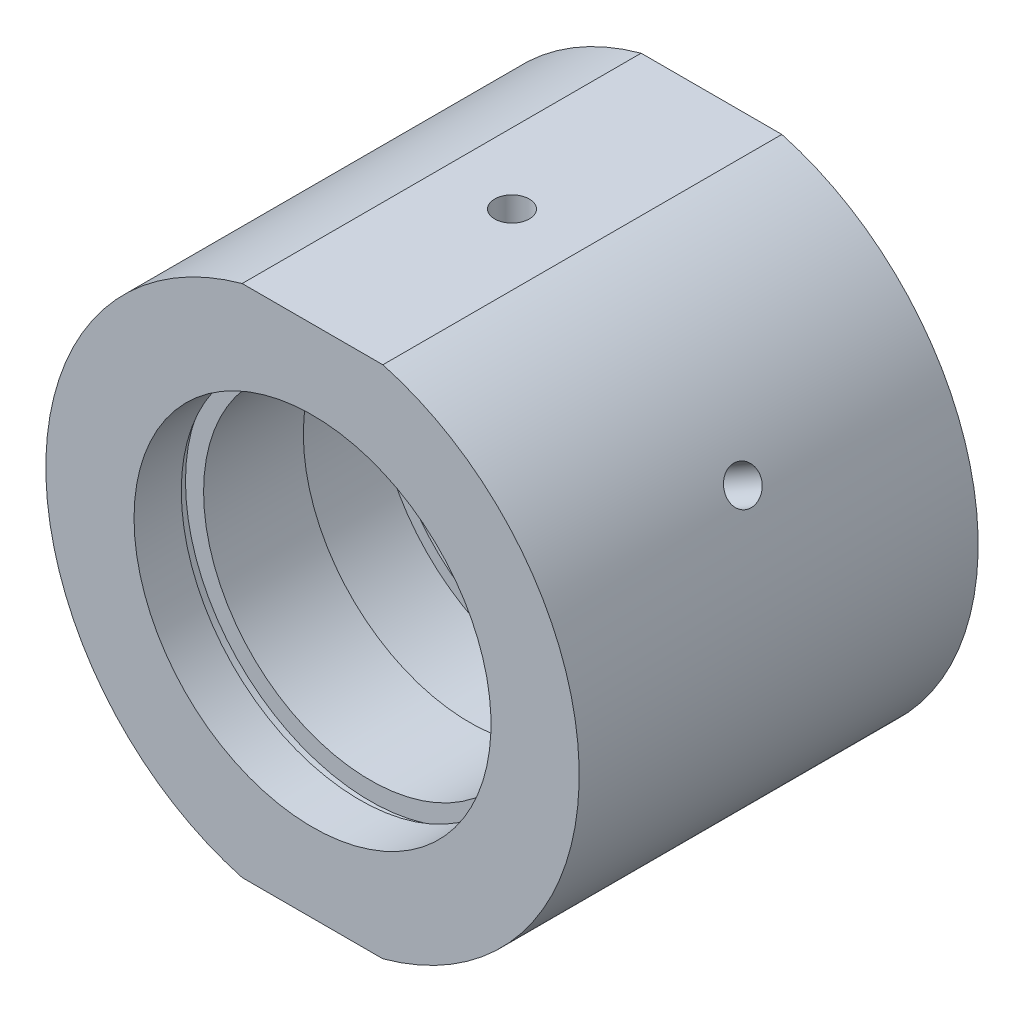
ISO-10303-21;
HEADER;
FILE_DESCRIPTION(('STEP AP214'),'2;1');
FILE_NAME('part.step','',(''),(''),'','','');
FILE_SCHEMA(('AUTOMOTIVE_DESIGN { 1 0 10303 214 1 1 1 1 }'));
ENDSEC;
DATA;
#1=APPLICATION_CONTEXT('core data for automotive mechanical design processes');
#2=APPLICATION_PROTOCOL_DEFINITION('international standard','automotive_design',2000,#1);
#3=PRODUCT_CONTEXT('',#1,'mechanical');
#4=PRODUCT('Part','Part','',(#3));
#5=PRODUCT_RELATED_PRODUCT_CATEGORY('part','',(#4));
#6=PRODUCT_DEFINITION_FORMATION('','',#4);
#7=PRODUCT_DEFINITION_CONTEXT('part definition',#1,'design');
#8=PRODUCT_DEFINITION('design','',#6,#7);
#9=PRODUCT_DEFINITION_SHAPE('','',#8);
#10=(LENGTH_UNIT() NAMED_UNIT(*) SI_UNIT(.MILLI.,.METRE.));
#11=(NAMED_UNIT(*) PLANE_ANGLE_UNIT() SI_UNIT($,.RADIAN.));
#12=(NAMED_UNIT(*) SI_UNIT($,.STERADIAN.) SOLID_ANGLE_UNIT());
#13=UNCERTAINTY_MEASURE_WITH_UNIT(LENGTH_MEASURE(1.E-05),#10,'distance_accuracy_value','');
#14=(GEOMETRIC_REPRESENTATION_CONTEXT(3) GLOBAL_UNCERTAINTY_ASSIGNED_CONTEXT((#13)) GLOBAL_UNIT_ASSIGNED_CONTEXT((#10,
#11,#12)) REPRESENTATION_CONTEXT('',''));
#15=CARTESIAN_POINT('',(0.,0.,0.));
#16=DIRECTION('',(0.,0.,1.));
#17=DIRECTION('',(1.,0.,0.));
#18=AXIS2_PLACEMENT_3D('',#15,#16,#17);
#19=CARTESIAN_POINT('',(0.,0.,-31.9390681003584));
#20=DIRECTION('',(0.,0.,-1.));
#21=DIRECTION('',(-1.,0.,0.));
#22=AXIS2_PLACEMENT_3D('',#19,#20,#21);
#23=CYLINDRICAL_SURFACE('',#22,25.4);
#24=CARTESIAN_POINT('',(21.1255837052229,14.1021173273243,0.));
#25=CARTESIAN_POINT('',(21.1255863615312,14.1021141605083,-0.0925762563152313));
#26=CARTESIAN_POINT('',(21.1299363854258,14.0956035641206,-0.18521714935843));
#27=CARTESIAN_POINT('',(21.1471903326474,14.0697041126058,-0.367940352830906));
#28=CARTESIAN_POINT('',(21.1601041850746,14.0503003087446,-0.458019566611406));
#29=CARTESIAN_POINT('',(21.1940041030208,13.9991116481198,-0.632946226853726));
#30=CARTESIAN_POINT('',(21.2149858749936,13.9673333766262,-0.717796428246381));
#31=CARTESIAN_POINT('',(21.2642526004663,13.8922125376661,-0.879890058522678));
#32=CARTESIAN_POINT('',(21.292535893129,13.8488725999941,-0.957135211772868));
#33=CARTESIAN_POINT('',(21.3554466990147,13.7516632788366,-1.1019726091419));
#34=CARTESIAN_POINT('',(21.3900831871358,13.6977789924932,-1.1695509539082));
#35=CARTESIAN_POINT('',(21.4644736584157,13.5809115475335,-1.29301742319575));
#36=CARTESIAN_POINT('',(21.5042278559428,13.5179280077581,-1.34890505776411));
#37=CARTESIAN_POINT('',(21.5875527489257,13.3844593266428,-1.44744666643091));
#38=CARTESIAN_POINT('',(21.631126729652,13.3139677164302,-1.49008910270414));
#39=CARTESIAN_POINT('',(21.7206441675858,13.1674212213743,-1.5608559839938));
#40=CARTESIAN_POINT('',(21.7665875977651,13.0913663999864,-1.58898059457471));
#41=CARTESIAN_POINT('',(21.8593422054505,12.9358933258085,-1.62987480068592));
#42=CARTESIAN_POINT('',(21.906152053296,12.8564800197265,-1.64266621735386));
#43=CARTESIAN_POINT('',(21.9993099582266,12.6964142499021,-1.65259832827394));
#44=CARTESIAN_POINT('',(22.0456580208599,12.6157618010774,-1.64973921079274));
#45=CARTESIAN_POINT('',(22.1365174445638,12.4556436472342,-1.62846939769358));
#46=CARTESIAN_POINT('',(22.1810314715213,12.3761763351589,-1.61008217447344));
#47=CARTESIAN_POINT('',(22.2671217856854,12.2206054060558,-1.55831452801675));
#48=CARTESIAN_POINT('',(22.3086980544109,12.1445018101899,-1.52493401046854));
#49=CARTESIAN_POINT('',(22.3879172153119,11.9978382471997,-1.4441007901877));
#50=CARTESIAN_POINT('',(22.4255571087251,11.9272825164906,-1.39663746316395));
#51=CARTESIAN_POINT('',(22.4960021791464,11.7938791572256,-1.28899366150815));
#52=CARTESIAN_POINT('',(22.5288072972254,11.7310316226231,-1.22881303189206));
#53=CARTESIAN_POINT('',(22.588934021688,11.6148335001785,-1.0973103933405));
#54=CARTESIAN_POINT('',(22.6162453867024,11.5615006700455,-1.02596800882872));
#55=CARTESIAN_POINT('',(22.664755296246,11.4661126921603,-0.87423835623214));
#56=CARTESIAN_POINT('',(22.6859538381281,11.4240575492917,-0.793851084230697));
#57=CARTESIAN_POINT('',(22.7218310998525,11.3525327799725,-0.626300386389157));
#58=CARTESIAN_POINT('',(22.7365094125979,11.3230639393645,-0.539136537845882));
#59=CARTESIAN_POINT('',(22.7590714641954,11.2776466843304,-0.360513015415987));
#60=CARTESIAN_POINT('',(22.7669552894322,11.2616980980085,-0.269053396161132));
#61=CARTESIAN_POINT('',(22.7757773944076,11.2438456563849,-0.084613406643308));
#62=CARTESIAN_POINT('',(22.7767283360383,11.2419161972317,0.0083638802715636));
#63=CARTESIAN_POINT('',(22.7717010905697,11.2520958233832,0.193357145884925));
#64=CARTESIAN_POINT('',(22.7657229424632,11.2642048296879,0.285373129990114));
#65=CARTESIAN_POINT('',(22.7469535565592,11.302059325108,0.465751060044094));
#66=CARTESIAN_POINT('',(22.7341682048513,11.3277930330357,0.554116091891323));
#67=CARTESIAN_POINT('',(22.7020224111887,11.3920789365367,0.724779041143212));
#68=CARTESIAN_POINT('',(22.6826619048223,11.4306312576839,0.80707689910293));
#69=CARTESIAN_POINT('',(22.6376996378619,11.5194194964734,0.963400248464823));
#70=CARTESIAN_POINT('',(22.6120888762405,11.5696722591463,1.03741358303071));
#71=CARTESIAN_POINT('',(22.5551499391607,11.6802855429439,1.17494441291505));
#72=CARTESIAN_POINT('',(22.5238217033653,11.7406461707372,1.23846179745541));
#73=CARTESIAN_POINT('',(22.4560577971483,11.8697422229493,1.35329408810745));
#74=CARTESIAN_POINT('',(22.419614533366,11.93849007816,1.4045905409198));
#75=CARTESIAN_POINT('',(22.3424817952513,12.0822245712966,1.49339854031989));
#76=CARTESIAN_POINT('',(22.3017923488145,12.1572111682362,1.53091017746014));
#77=CARTESIAN_POINT('',(22.2171899924813,12.3111400494117,1.59105167185681));
#78=CARTESIAN_POINT('',(22.1732796363469,12.3900791843691,1.6136931803907));
#79=CARTESIAN_POINT('',(22.0833510532279,12.5496609908419,1.64348983344683));
#80=CARTESIAN_POINT('',(22.0373328489618,12.6303036439917,1.65064514484041));
#81=CARTESIAN_POINT('',(21.9445519782846,12.7908255022556,1.64926464318744));
#82=CARTESIAN_POINT('',(21.8977908385922,12.8707058396567,1.64075769659949));
#83=CARTESIAN_POINT('',(21.8048098503978,13.0276086425459,1.60835404670283));
#84=CARTESIAN_POINT('',(21.7585900028295,13.1046311031043,1.584457316849));
#85=CARTESIAN_POINT('',(21.6681118736425,13.2536989678976,1.52195905008009));
#86=CARTESIAN_POINT('',(21.6238535702055,13.3257444274968,1.48335767677137));
#87=CARTESIAN_POINT('',(21.5387155385461,13.4629216075301,1.39254977966907));
#88=CARTESIAN_POINT('',(21.4978357262853,13.5280534999474,1.34034359442331));
#89=CARTESIAN_POINT('',(21.420742973893,13.6497978206802,1.22370103592582));
#90=CARTESIAN_POINT('',(21.3845382072521,13.7063953563964,1.15924371720355));
#91=CARTESIAN_POINT('',(21.3181153252652,13.809479721239,1.0199581955059));
#92=CARTESIAN_POINT('',(21.2878986755489,13.8559640753715,0.945127461168911));
#93=CARTESIAN_POINT('',(21.2344988622279,13.937663029851,0.787127696262788));
#94=CARTESIAN_POINT('',(21.2113249285851,13.9728628443212,0.703947911881445));
#95=CARTESIAN_POINT('',(21.1729283497024,14.0309775009916,0.531749358735035));
#96=CARTESIAN_POINT('',(21.1576964096522,14.0539067047765,0.442737553421857));
#97=CARTESIAN_POINT('',(21.1396971044625,14.0809571867969,0.294319263500427));
#98=CARTESIAN_POINT('',(21.1344131421564,14.0888829299295,0.235871694983987));
#99=CARTESIAN_POINT('',(21.1273555964686,14.0994640080415,0.118291548613023));
#100=CARTESIAN_POINT('',(21.1255820077632,14.1021193510136,0.0591589717974801));
#101=CARTESIAN_POINT('',(21.1255837052229,14.1021173273243,0.));
#102=B_SPLINE_CURVE_WITH_KNOTS('',3,(#24,#25,#26,#27,#28,#29,#30,#31,#32,#33,#34,#35,#36,#37,
#38,#39,#40,#41,#42,#43,#44,#45,#46,#47,#48,#49,#50,#51,#52,#53,#54,#55,#56,#57,#58,#59,#60,#61,
#62,#63,#64,#65,#66,#67,#68,#69,#70,#71,#72,#73,#74,#75,#76,#77,#78,#79,#80,#81,#82,#83,#84,#85,
#86,#87,#88,#89,#90,#91,#92,#93,#94,#95,#96,#97,#98,#99,#100,#101),.UNSPECIFIED.,.T.,.F.,(4,2,2,
2,2,2,2,2,2,2,2,2,2,2,2,2,2,2,2,2,2,2,2,2,2,2,2,2,2,2,2,2,2,2,2,2,2,2,4),(0.,0.277512798480437,
0.555347915558792,0.833035379869696,1.11065973569114,1.3886793435063,1.66671060067618,
1.94498337461715,2.22325297500385,2.50112608945466,2.77899586126355,3.05644635337374,
3.33389859074278,3.61156067692888,3.88922614713996,4.16740453539096,4.44558304409999,
4.72377891872059,5.00197125632304,5.27965538897227,5.55733795898814,5.83478080996284,
6.11222637890523,6.39007388121363,6.66792431583897,6.94619167560213,7.22445720739306,
7.50250444724587,7.78054869098886,8.05808099582018,8.33561377935527,8.6131434751036,
8.89066626534624,9.16866786858892,9.44673743068541,9.72516986585113,10.0032757055969,
10.1806148784035,10.3579537822671),.UNSPECIFIED.);
#103=CARTESIAN_POINT('',(21.1255837052229,14.1021173273243,0.));
#104=VERTEX_POINT('',#103);
#105=EDGE_CURVE('E11',#104,#104,#102,.T.);
#106=ORIENTED_EDGE('',*,*,#105,.T.);
#107=EDGE_LOOP('',(#106));
#108=FACE_BOUND('',#107,.T.);
#109=CARTESIAN_POINT('',(0.,0.,19.));
#110=DIRECTION('',(0.,0.,-1.));
#111=DIRECTION('',(-1.,0.,0.));
#112=AXIS2_PLACEMENT_3D('',#109,#110,#111);
#113=CIRCLE('',#112,25.4);
#114=CARTESIAN_POINT('',(6.70149237110659,24.5,19.));
#115=VERTEX_POINT('',#114);
#116=CARTESIAN_POINT('',(6.70149237110658,-24.5,19.));
#117=VERTEX_POINT('',#116);
#118=EDGE_CURVE('E199',#115,#117,#113,.T.);
#119=ORIENTED_EDGE('',*,*,#118,.T.);
#120=DIRECTION('',(0.,0.,-1.));
#121=VECTOR('',#120,1.);
#122=CARTESIAN_POINT('',(6.70149237110663,-24.5,-31.9390681003584));
#123=LINE('',#122,#121);
#124=CARTESIAN_POINT('',(6.7014923711066,-24.5,-19.));
#125=VERTEX_POINT('',#124);
#126=EDGE_CURVE('E64',#117,#125,#123,.T.);
#127=ORIENTED_EDGE('',*,*,#126,.T.);
#128=CARTESIAN_POINT('',(0.,0.,-19.));
#129=DIRECTION('',(0.,0.,-1.));
#130=DIRECTION('',(-1.,0.,0.));
#131=AXIS2_PLACEMENT_3D('',#128,#129,#130);
#132=CIRCLE('',#131,25.4);
#133=CARTESIAN_POINT('',(6.70149237110663,24.5,-19.));
#134=VERTEX_POINT('',#133);
#135=EDGE_CURVE('E204',#134,#125,#132,.T.);
#136=ORIENTED_EDGE('',*,*,#135,.F.);
#137=DIRECTION('',(0.,0.,-1.));
#138=VECTOR('',#137,1.);
#139=CARTESIAN_POINT('',(6.70149237110663,24.5,-31.9390681003584));
#140=LINE('',#139,#138);
#141=EDGE_CURVE('E134',#134,#115,#140,.F.);
#142=ORIENTED_EDGE('',*,*,#141,.T.);
#143=EDGE_LOOP('',(#119,#127,#136,#142));
#144=FACE_BOUND('',#143,.T.);
#145=ADVANCED_FACE('F43',(#108,#144),#23,.T.);
#146=CARTESIAN_POINT('',(17.,0.,-19.));
#147=DIRECTION('',(0.,0.,1.));
#148=DIRECTION('',(1.,0.,0.));
#149=AXIS2_PLACEMENT_3D('',#146,#147,#148);
#150=PLANE('',#149);
#151=CARTESIAN_POINT('',(0.,0.,-19.));
#152=DIRECTION('',(0.,0.,-1.));
#153=DIRECTION('',(-1.,0.,0.));
#154=AXIS2_PLACEMENT_3D('',#151,#152,#153);
#155=CIRCLE('',#154,17.);
#156=CARTESIAN_POINT('',(-17.,0.,-19.));
#157=VERTEX_POINT('',#156);
#158=EDGE_CURVE('E145',#157,#157,#155,.T.);
#159=ORIENTED_EDGE('',*,*,#158,.F.);
#160=EDGE_LOOP('',(#159));
#161=FACE_BOUND('',#160,.T.);
#162=ORIENTED_EDGE('',*,*,#135,.T.);
#163=DIRECTION('',(-1.,0.,0.));
#164=VECTOR('',#163,1.);
#165=CARTESIAN_POINT('',(17.,-24.5,-19.));
#166=LINE('',#165,#164);
#167=CARTESIAN_POINT('',(-6.70149237110662,-24.5,-19.));
#168=VERTEX_POINT('',#167);
#169=EDGE_CURVE('E128',#125,#168,#166,.T.);
#170=ORIENTED_EDGE('',*,*,#169,.T.);
#171=CARTESIAN_POINT('',(-6.70149237110659,24.5,-19.));
#172=VERTEX_POINT('',#171);
#173=EDGE_CURVE('E203',#168,#172,#132,.T.);
#174=ORIENTED_EDGE('',*,*,#173,.T.);
#175=DIRECTION('',(1.,0.,0.));
#176=VECTOR('',#175,1.);
#177=CARTESIAN_POINT('',(17.,24.5,-19.));
#178=LINE('',#177,#176);
#179=EDGE_CURVE('E138',#172,#134,#178,.T.);
#180=ORIENTED_EDGE('',*,*,#179,.T.);
#181=EDGE_LOOP('',(#162,#170,#174,#180));
#182=FACE_BOUND('',#181,.T.);
#183=ADVANCED_FACE('F45',(#161,#182),#150,.F.);
#184=CARTESIAN_POINT('',(-22.7755837052229,11.2442334948357,0.));
#185=CARTESIAN_POINT('',(-22.7755822908339,11.2442373786741,-0.0925762563152313));
#186=CARTESIAN_POINT('',(-22.7721189609157,11.2512599080678,-0.18521714935843));
#187=CARTESIAN_POINT('',(-22.7583163515706,11.2791519904346,-0.367940352830905));
#188=CARTESIAN_POINT('',(-22.7479690907104,11.3000376166279,-0.458019566611405));
#189=CARTESIAN_POINT('',(-22.7205883691967,11.354990137068,-0.632946226853726));
#190=CARTESIAN_POINT('',(-22.7035584647813,11.3890500203596,-0.717796428246382));
#191=CARTESIAN_POINT('',(-22.6631352726245,11.4692766756603,-0.879890058522679));
#192=CARTESIAN_POINT('',(-22.6397434319336,11.5154406944448,-0.957135211772868));
#193=CARTESIAN_POINT('',(-22.5870130932694,11.6185277110931,-1.1019726091419));
#194=CARTESIAN_POINT('',(-22.5576661764917,11.6754659328756,-1.1695509539082));
#195=CARTESIAN_POINT('',(-22.4936512359212,11.7983236932834,-1.29301742319575));
#196=CARTESIAN_POINT('',(-22.458982989219,11.8642436081366,-1.34890505776411));
#197=CARTESIAN_POINT('',(-22.3850581672549,12.0031394227851,-1.44744666643091));
#198=CARTESIAN_POINT('',(-22.3457976324203,12.0761214021443,-1.49008910270414));
#199=CARTESIAN_POINT('',(-22.2636433638333,12.2269190250046,-1.5608559839938));
#200=CARTESIAN_POINT('',(-22.2207496715207,12.3047346133709,-1.58898059457471));
#201=CARTESIAN_POINT('',(-22.1324833435209,12.4627989970334,-1.62987480068592));
#202=CARTESIAN_POINT('',(-22.0871143269781,12.543044167456,-1.64266621735386));
#203=CARTESIAN_POINT('',(-21.9950722564991,12.7037541646014,-1.65259832827394));
#204=CARTESIAN_POINT('',(-21.9483992182562,12.7842189886703,-1.64973921079274));
#205=CARTESIAN_POINT('',(-21.8551625412728,12.9429646346928,-1.62846939769358));
#206=CARTESIAN_POINT('',(-21.8085988437239,13.0212485689004,-1.61008217447344));
#207=CARTESIAN_POINT('',(-21.7169156241123,13.1735904325378,-1.55831452801675));
#208=CARTESIAN_POINT('',(-21.6717961111359,13.2476483353816,-1.52493401046854));
#209=CARTESIAN_POINT('',(-21.5843913202273,13.3895859226834,-1.4441007901877));
#210=CARTESIAN_POINT('',(-21.5421082117573,13.4574608919296,-1.39663746316395));
#211=CARTESIAN_POINT('',(-21.4618000488942,13.5851697921183,-1.28899366150815));
#212=CARTESIAN_POINT('',(-21.4237750464028,13.6450036250501,-1.22881303189206));
#213=CARTESIAN_POINT('',(-21.353207882725,13.7551739571033,-1.0973103933405));
#214=CARTESIAN_POINT('',(-21.3206759794812,13.8054927080844,-1.02596800882872));
#215=CARTESIAN_POINT('',(-21.2623225221888,13.8951975110269,-0.874238356232141));
#216=CARTESIAN_POINT('',(-21.2365009710459,13.9345835582543,-0.793851084230697));
#217=CARTESIAN_POINT('',(-21.1924973346779,14.0014165629856,-0.626300386389158));
#218=CARTESIAN_POINT('',(-21.174315726464,14.0288627750118,-0.539136537845883));
#219=CARTESIAN_POINT('',(-21.146264255633,14.0711107123737,-0.360513015415987));
#220=CARTESIAN_POINT('',(-21.1363942873422,14.0859125984687,-0.269053396161133));
#221=CARTESIAN_POINT('',(-21.1253446718643,14.1024789863041,-0.0846134066433096));
#222=CARTESIAN_POINT('',(-21.1241491820374,14.1042672554904,0.00836388027156205));
#223=CARTESIAN_POINT('',(-21.1304513741514,14.0948237201278,0.193357145884924));
#224=CARTESIAN_POINT('',(-21.1379490071725,14.0835919888476,0.285373129990113));
#225=CARTESIAN_POINT('',(-21.1613472689018,14.0484099761313,0.465751060044094));
#226=CARTESIAN_POINT('',(-21.1772406378468,14.0244706827921,0.554116091891324));
#227=CARTESIAN_POINT('',(-21.2168409665526,13.9644886571049,0.724779041143212));
#228=CARTESIAN_POINT('',(-21.2405480028578,13.9284458061879,0.80707689910293));
#229=CARTESIAN_POINT('',(-21.2949597397265,13.8451132213937,0.963400248464822));
#230=CARTESIAN_POINT('',(-21.3256745280009,13.7978072698828,1.03741358303071));
#231=CARTESIAN_POINT('',(-21.3929989732258,13.6931900620084,1.17494441291505));
#232=CARTESIAN_POINT('',(-21.4296086923854,13.6358787000573,1.23846179745541));
#233=CARTESIAN_POINT('',(-21.5075272000209,13.5126454097076,1.35329408810745));
#234=CARTESIAN_POINT('',(-21.5488429571979,13.4467106898699,1.4045905409198));
#235=CARTESIAN_POINT('',(-21.6347543105969,13.3080445326309,1.49339854031989));
#236=CARTESIAN_POINT('',(-21.6793498852716,13.2353131398808,1.53091017746014));
#237=CARTESIAN_POINT('',(-21.7703550285791,13.0850809094885,1.59105167185681));
#238=CARTESIAN_POINT('',(-21.8167631467377,13.0075838581083,1.6136931803907));
#239=CARTESIAN_POINT('',(-21.9100007535655,12.8499125173645,1.64348983344683));
#240=CARTESIAN_POINT('',(-21.9568302376888,12.7697382568586,1.65064514484041));
#241=CARTESIAN_POINT('',(-22.0494558094694,12.6091267367349,1.64926464318744));
#242=CARTESIAN_POINT('',(-22.0952536410754,12.5286902331509,1.64075769659949));
#243=CARTESIAN_POINT('',(-22.1846449602052,12.3697149338609,1.60835404670283));
#244=CARTESIAN_POINT('',(-22.2282384439266,12.2911761414285,1.584457316849));
#245=CARTESIAN_POINT('',(-22.312095937132,12.138285850669,1.52195905008009));
#246=CARTESIAN_POINT('',(-22.3523599836538,12.0639343057646,1.48335767677137));
#247=CARTESIAN_POINT('',(-22.4285898905524,11.9216140175027,1.39254977966907));
#248=CARTESIAN_POINT('',(-22.464555857852,11.8536451153743,1.34034359442331));
#249=CARTESIAN_POINT('',(-22.5314431561769,11.7260086729885,1.22370103592582));
#250=CARTESIAN_POINT('',(-22.5623556765783,11.6663556574813,1.15924371720355));
#251=CARTESIAN_POINT('',(-22.6184179142715,11.5572895718667,1.0199581955059));
#252=CARTESIAN_POINT('',(-22.6435662209706,11.5078790085289,0.945127461168911));
#253=CARTESIAN_POINT('',(-22.687619684352,11.4207839363958,0.787127696262787));
#254=CARTESIAN_POINT('',(-22.7065166510703,11.3831148139204,0.703947911881444));
#255=CARTESIAN_POINT('',(-22.7376471306378,11.3208050728544,0.531749358735035));
#256=CARTESIAN_POINT('',(-22.7498884335789,11.2961492239296,0.442737553421858));
#257=CARTESIAN_POINT('',(-22.7643151855984,11.2670361273747,0.294319263500428));
#258=CARTESIAN_POINT('',(-22.768537099342,11.2584972102186,0.235871694983988));
#259=CARTESIAN_POINT('',(-22.7741718089425,11.2470946573086,0.118291548613022));
#260=CARTESIAN_POINT('',(-22.7755846090594,11.2442310129478,0.05915897179748));
#261=CARTESIAN_POINT('',(-22.7755837052229,11.2442334948357,0.));
#262=B_SPLINE_CURVE_WITH_KNOTS('',3,(#184,#185,#186,#187,#188,#189,#190,#191,#192,#193,#194,
#195,#196,#197,#198,#199,#200,#201,#202,#203,#204,#205,#206,#207,#208,#209,#210,#211,#212,#213,
#214,#215,#216,#217,#218,#219,#220,#221,#222,#223,#224,#225,#226,#227,#228,#229,#230,#231,#232,
#233,#234,#235,#236,#237,#238,#239,#240,#241,#242,#243,#244,#245,#246,#247,#248,#249,#250,#251,
#252,#253,#254,#255,#256,#257,#258,#259,#260,#261),.UNSPECIFIED.,.T.,.F.,(4,2,2,2,2,2,2,2,2,2,2,
2,2,2,2,2,2,2,2,2,2,2,2,2,2,2,2,2,2,2,2,2,2,2,2,2,2,2,4),(0.,0.277512798480437,
0.555347915558792,0.833035379869698,1.11065973569114,1.3886793435063,1.66671060067618,
1.94498337461716,2.22325297500385,2.50112608945466,2.77899586126355,3.05644635337374,
3.33389859074278,3.61156067692888,3.88922614713996,4.16740453539097,4.44558304409999,
4.72377891872059,5.00197125632304,5.27965538897227,5.55733795898814,5.83478080996284,
6.11222637890523,6.39007388121363,6.66792431583897,6.94619167560213,7.22445720739306,
7.50250444724587,7.78054869098886,8.05808099582019,8.33561377935528,8.6131434751036,
8.89066626534624,9.16866786858892,9.44673743068542,9.72516986585113,10.0032757055969,
10.1806148784035,10.3579537822671),.UNSPECIFIED.);
#263=CARTESIAN_POINT('',(-22.7755837052229,11.2442334948357,0.));
#264=VERTEX_POINT('',#263);
#265=EDGE_CURVE('E232',#264,#264,#262,.T.);
#266=ORIENTED_EDGE('',*,*,#265,.T.);
#267=EDGE_LOOP('',(#266));
#268=FACE_BOUND('',#267,.T.);
#269=ORIENTED_EDGE('',*,*,#173,.F.);
#270=DIRECTION('',(0.,0.,-1.));
#271=VECTOR('',#270,1.);
#272=CARTESIAN_POINT('',(-6.70149237110663,-24.5,-31.9390681003584));
#273=LINE('',#272,#271);
#274=CARTESIAN_POINT('',(-6.70149237110657,-24.5,19.));
#275=VERTEX_POINT('',#274);
#276=EDGE_CURVE('E125',#168,#275,#273,.F.);
#277=ORIENTED_EDGE('',*,*,#276,.T.);
#278=CARTESIAN_POINT('',(-6.70149237110657,24.5,19.));
#279=VERTEX_POINT('',#278);
#280=EDGE_CURVE('E72',#275,#279,#113,.T.);
#281=ORIENTED_EDGE('',*,*,#280,.T.);
#282=DIRECTION('',(0.,0.,-1.));
#283=VECTOR('',#282,1.);
#284=CARTESIAN_POINT('',(-6.70149237110663,24.5,-31.9390681003584));
#285=LINE('',#284,#283);
#286=EDGE_CURVE('E142',#279,#172,#285,.T.);
#287=ORIENTED_EDGE('',*,*,#286,.T.);
#288=EDGE_LOOP('',(#269,#277,#281,#287));
#289=FACE_BOUND('',#288,.T.);
#290=ADVANCED_FACE('F216',(#268,#289),#23,.T.);
#291=CARTESIAN_POINT('',(25.4,0.,19.));
#292=DIRECTION('',(0.,0.,-1.));
#293=DIRECTION('',(-1.,0.,0.));
#294=AXIS2_PLACEMENT_3D('',#291,#292,#293);
#295=PLANE('',#294);
#296=ORIENTED_EDGE('',*,*,#280,.F.);
#297=DIRECTION('',(1.,0.,0.));
#298=VECTOR('',#297,1.);
#299=CARTESIAN_POINT('',(25.4,-24.5,19.));
#300=LINE('',#299,#298);
#301=EDGE_CURVE('E57',#275,#117,#300,.T.);
#302=ORIENTED_EDGE('',*,*,#301,.T.);
#303=ORIENTED_EDGE('',*,*,#118,.F.);
#304=DIRECTION('',(-1.,0.,0.));
#305=VECTOR('',#304,1.);
#306=CARTESIAN_POINT('',(25.4,24.5,19.));
#307=LINE('',#306,#305);
#308=EDGE_CURVE('E208',#115,#279,#307,.T.);
#309=ORIENTED_EDGE('',*,*,#308,.T.);
#310=EDGE_LOOP('',(#296,#302,#303,#309));
#311=FACE_BOUND('',#310,.T.);
#312=CARTESIAN_POINT('',(0.,0.,19.));
#313=DIRECTION('',(0.,0.,-1.));
#314=DIRECTION('',(-1.,0.,0.));
#315=AXIS2_PLACEMENT_3D('',#312,#313,#314);
#316=CIRCLE('',#315,17.);
#317=CARTESIAN_POINT('',(-17.,0.,19.));
#318=VERTEX_POINT('',#317);
#319=EDGE_CURVE('E195',#318,#318,#316,.T.);
#320=ORIENTED_EDGE('',*,*,#319,.T.);
#321=EDGE_LOOP('',(#320));
#322=FACE_BOUND('',#321,.T.);
#323=ADVANCED_FACE('F266',(#311,#322),#295,.F.);
#324=CARTESIAN_POINT('',(0.,0.,-31.9390681003584));
#325=DIRECTION('',(0.,0.,-1.));
#326=DIRECTION('',(-1.,0.,0.));
#327=AXIS2_PLACEMENT_3D('',#324,#325,#326);
#328=CYLINDRICAL_SURFACE('',#327,17.);
#329=ORIENTED_EDGE('',*,*,#319,.F.);
#330=EDGE_LOOP('',(#329));
#331=FACE_BOUND('',#330,.T.);
#332=CARTESIAN_POINT('',(0.,0.,14.5));
#333=DIRECTION('',(0.,0.,-1.));
#334=DIRECTION('',(-1.,0.,0.));
#335=AXIS2_PLACEMENT_3D('',#332,#333,#334);
#336=CIRCLE('',#335,17.);
#337=CARTESIAN_POINT('',(-17.,0.,14.5));
#338=VERTEX_POINT('',#337);
#339=EDGE_CURVE('E191',#338,#338,#336,.T.);
#340=ORIENTED_EDGE('',*,*,#339,.T.);
#341=EDGE_LOOP('',(#340));
#342=FACE_BOUND('',#341,.T.);
#343=ADVANCED_FACE('F263',(#331,#342),#328,.F.);
#344=CARTESIAN_POINT('',(17.,0.,14.5));
#345=DIRECTION('',(0.,0.,1.));
#346=DIRECTION('',(1.,0.,0.));
#347=AXIS2_PLACEMENT_3D('',#344,#345,#346);
#348=PLANE('',#347);
#349=ORIENTED_EDGE('',*,*,#339,.F.);
#350=EDGE_LOOP('',(#349));
#351=FACE_BOUND('',#350,.T.);
#352=CARTESIAN_POINT('',(0.,0.,14.5));
#353=DIRECTION('',(0.,0.,-1.));
#354=DIRECTION('',(-1.,0.,0.));
#355=AXIS2_PLACEMENT_3D('',#352,#353,#354);
#356=CIRCLE('',#355,17.6);
#357=CARTESIAN_POINT('',(-17.6,0.,14.5));
#358=VERTEX_POINT('',#357);
#359=EDGE_CURVE('E187',#358,#358,#356,.T.);
#360=ORIENTED_EDGE('',*,*,#359,.T.);
#361=EDGE_LOOP('',(#360));
#362=FACE_BOUND('',#361,.T.);
#363=ADVANCED_FACE('F259',(#351,#362),#348,.F.);
#364=CARTESIAN_POINT('',(0.,0.,-31.9390681003584));
#365=DIRECTION('',(0.,0.,-1.));
#366=DIRECTION('',(-1.,0.,0.));
#367=AXIS2_PLACEMENT_3D('',#364,#365,#366);
#368=CYLINDRICAL_SURFACE('',#367,17.6);
#369=ORIENTED_EDGE('',*,*,#359,.F.);
#370=EDGE_LOOP('',(#369));
#371=FACE_BOUND('',#370,.T.);
#372=CARTESIAN_POINT('',(0.,0.,13.5));
#373=DIRECTION('',(0.,0.,-1.));
#374=DIRECTION('',(-1.,0.,0.));
#375=AXIS2_PLACEMENT_3D('',#372,#373,#374);
#376=CIRCLE('',#375,17.6);
#377=CARTESIAN_POINT('',(-17.6,0.,13.5));
#378=VERTEX_POINT('',#377);
#379=EDGE_CURVE('E183',#378,#378,#376,.T.);
#380=ORIENTED_EDGE('',*,*,#379,.T.);
#381=EDGE_LOOP('',(#380));
#382=FACE_BOUND('',#381,.T.);
#383=ADVANCED_FACE('F255',(#371,#382),#368,.F.);
#384=CARTESIAN_POINT('',(17.6,0.,13.5));
#385=DIRECTION('',(0.,0.,-1.));
#386=DIRECTION('',(-1.,0.,0.));
#387=AXIS2_PLACEMENT_3D('',#384,#385,#386);
#388=PLANE('',#387);
#389=ORIENTED_EDGE('',*,*,#379,.F.);
#390=EDGE_LOOP('',(#389));
#391=FACE_BOUND('',#390,.T.);
#392=CARTESIAN_POINT('',(0.,0.,13.5));
#393=DIRECTION('',(0.,0.,-1.));
#394=DIRECTION('',(-1.,0.,0.));
#395=AXIS2_PLACEMENT_3D('',#392,#393,#394);
#396=CIRCLE('',#395,15.875);
#397=CARTESIAN_POINT('',(-15.875,0.,13.5));
#398=VERTEX_POINT('',#397);
#399=EDGE_CURVE('E179',#398,#398,#396,.T.);
#400=ORIENTED_EDGE('',*,*,#399,.T.);
#401=EDGE_LOOP('',(#400));
#402=FACE_BOUND('',#401,.T.);
#403=ADVANCED_FACE('F251',(#391,#402),#388,.F.);
#404=CARTESIAN_POINT('',(0.,0.,-31.9390681003584));
#405=DIRECTION('',(0.,0.,-1.));
#406=DIRECTION('',(-1.,0.,0.));
#407=AXIS2_PLACEMENT_3D('',#404,#405,#406);
#408=CYLINDRICAL_SURFACE('',#407,15.875);
#409=ORIENTED_EDGE('',*,*,#399,.F.);
#410=EDGE_LOOP('',(#409));
#411=FACE_BOUND('',#410,.T.);
#412=CARTESIAN_POINT('',(0.,0.,4.));
#413=DIRECTION('',(0.,0.,-1.));
#414=DIRECTION('',(-1.,0.,0.));
#415=AXIS2_PLACEMENT_3D('',#412,#413,#414);
#416=CIRCLE('',#415,15.875);
#417=CARTESIAN_POINT('',(-15.875,0.,4.));
#418=VERTEX_POINT('',#417);
#419=EDGE_CURVE('E176',#418,#418,#416,.T.);
#420=ORIENTED_EDGE('',*,*,#419,.T.);
#421=EDGE_LOOP('',(#420));
#422=FACE_BOUND('',#421,.T.);
#423=ADVANCED_FACE('F247',(#411,#422),#408,.F.);
#424=CARTESIAN_POINT('',(15.875,0.,4.));
#425=DIRECTION('',(0.,0.,1.));
#426=DIRECTION('',(1.,0.,0.));
#427=AXIS2_PLACEMENT_3D('',#424,#425,#426);
#428=PLANE('',#427);
#429=ORIENTED_EDGE('',*,*,#419,.F.);
#430=EDGE_LOOP('',(#429));
#431=FACE_BOUND('',#430,.T.);
#432=CARTESIAN_POINT('',(0.,0.,4.));
#433=DIRECTION('',(0.,0.,-1.));
#434=DIRECTION('',(-1.,0.,0.));
#435=AXIS2_PLACEMENT_3D('',#432,#433,#434);
#436=CIRCLE('',#435,16.975);
#437=CARTESIAN_POINT('',(-16.975,0.,4.));
#438=VERTEX_POINT('',#437);
#439=EDGE_CURVE('E172',#438,#438,#436,.T.);
#440=ORIENTED_EDGE('',*,*,#439,.T.);
#441=EDGE_LOOP('',(#440));
#442=FACE_BOUND('',#441,.T.);
#443=ADVANCED_FACE('F241',(#431,#442),#428,.F.);
#444=CARTESIAN_POINT('',(0.,0.,-31.9390681003584));
#445=DIRECTION('',(0.,0.,-1.));
#446=DIRECTION('',(-1.,0.,0.));
#447=AXIS2_PLACEMENT_3D('',#444,#445,#446);
#448=CYLINDRICAL_SURFACE('',#447,16.975);
#449=CARTESIAN_POINT('',(-15.4561685708968,7.01836719672184,0.));
#450=CARTESIAN_POINT('',(-15.4561674795785,7.01837119809081,0.0924460358637894));
#451=CARTESIAN_POINT('',(-15.4529350311263,7.02550177648189,0.18495352427115));
#452=CARTESIAN_POINT('',(-15.4400339349701,7.05380816834611,0.367404644242963));
#453=CARTESIAN_POINT('',(-15.4303581581889,7.07499953897604,0.457345320737861));
#454=CARTESIAN_POINT('',(-15.4046914043663,7.13071123103747,0.631994170208554));
#455=CARTESIAN_POINT('',(-15.3887042109307,7.16522356646168,0.716705443019644));
#456=CARTESIAN_POINT('',(-15.350627046165,7.24643885921021,0.878548575935685));
#457=CARTESIAN_POINT('',(-15.3285383035552,7.29313936199632,0.955681957829093));
#458=CARTESIAN_POINT('',(-15.2784957418457,7.39740068644304,1.10046401838795));
#459=CARTESIAN_POINT('',(-15.2505241791438,7.45499430948171,1.16808294588381));
#460=CARTESIAN_POINT('',(-15.1892078240735,7.57914070317203,1.29166055792703));
#461=CARTESIAN_POINT('',(-15.1558627880103,7.64569388013006,1.34761871337722));
#462=CARTESIAN_POINT('',(-15.0843429741025,7.78584704913896,1.44638855509568));
#463=CARTESIAN_POINT('',(-15.0461587683665,7.85946072680084,1.4891740041316));
#464=CARTESIAN_POINT('',(-14.9658194691904,8.01138242252531,1.56021606491202));
#465=CARTESIAN_POINT('',(-14.9236644676315,8.08969033195177,1.5884730127371));
#466=CARTESIAN_POINT('',(-14.836530683038,8.24840272396984,1.62956895975003));
#467=CARTESIAN_POINT('',(-14.7915613070394,8.32879974663584,1.64245670780162));
#468=CARTESIAN_POINT('',(-14.6998714184018,8.48957995537193,1.65259923223924));
#469=CARTESIAN_POINT('',(-14.6531509488798,8.56996314173382,1.64985439329463));
#470=CARTESIAN_POINT('',(-14.5594733354019,8.72816052822291,1.62884928547987));
#471=CARTESIAN_POINT('',(-14.512517523264,8.80598248624426,1.61064143683254));
#472=CARTESIAN_POINT('',(-14.4196676895802,8.95721426464572,1.55930879943897));
#473=CARTESIAN_POINT('',(-14.3737736811791,9.03062403042163,1.52618382612511));
#474=CARTESIAN_POINT('',(-14.2844812923172,9.17121439100433,1.44589958863717));
#475=CARTESIAN_POINT('',(-14.2410871889745,9.2383844237634,1.39871707722609));
#476=CARTESIAN_POINT('',(-14.1583781236576,9.36464946753592,1.29167398188222));
#477=CARTESIAN_POINT('',(-14.1190632747137,9.42374425481017,1.231813046788));
#478=CARTESIAN_POINT('',(-14.0457830793002,9.53262485982912,1.10081741060727));
#479=CARTESIAN_POINT('',(-14.0118405241704,9.58237117641102,1.02963711804075));
#480=CARTESIAN_POINT('',(-13.9507912007046,9.67103701608635,0.878181531727665));
#481=CARTESIAN_POINT('',(-13.9236844414099,9.7099565248599,0.797906225951942));
#482=CARTESIAN_POINT('',(-13.8773710583936,9.77603365013845,0.630504833100123));
#483=CARTESIAN_POINT('',(-13.8581659637242,9.8031889902113,0.543377423954368));
#484=CARTESIAN_POINT('',(-13.8284466185458,9.84506751597743,0.364762000432686));
#485=CARTESIAN_POINT('',(-13.8179321181678,9.85979105910557,0.273274111507713));
#486=CARTESIAN_POINT('',(-13.8060554020302,9.87641459114903,0.0889348596721373));
#487=CARTESIAN_POINT('',(-13.804655971794,9.87836672258394,-0.0039094061042639));
#488=CARTESIAN_POINT('',(-13.8109686880388,9.86953885403532,-0.188677191006078));
#489=CARTESIAN_POINT('',(-13.8186807183154,9.85875901643104,-0.280600721859157));
#490=CARTESIAN_POINT('',(-13.842871844845,9.82476225942692,-0.46073230911861));
#491=CARTESIAN_POINT('',(-13.8593335394367,9.80157002563567,-0.548947366601064));
#492=CARTESIAN_POINT('',(-13.9003452621319,9.74332017217179,-0.719375393004221));
#493=CARTESIAN_POINT('',(-13.9248954655815,9.70826229527018,-0.801588231759043));
#494=CARTESIAN_POINT('',(-13.9812078076748,9.62698789882404,-0.95796894587716));
#495=CARTESIAN_POINT('',(-14.0129929198233,9.5807358032341,-1.03211005721146));
#496=CARTESIAN_POINT('',(-14.0825152223566,9.47824953802466,-1.16997148044241));
#497=CARTESIAN_POINT('',(-14.1202525519556,9.4220151349285,-1.23369154853378));
#498=CARTESIAN_POINT('',(-14.2004291620293,9.30073806130375,-1.34912159213929));
#499=CARTESIAN_POINT('',(-14.2428839913561,9.23566609564929,-1.40079000103762));
#500=CARTESIAN_POINT('',(-14.3308847665201,9.098516159759,-1.49036416634794));
#501=CARTESIAN_POINT('',(-14.376430672032,9.02643828091495,-1.52827010226016));
#502=CARTESIAN_POINT('',(-14.4689946408248,8.87730262886373,-1.58917270829971));
#503=CARTESIAN_POINT('',(-14.5160100722985,8.80025352178912,-1.61219459201974));
#504=CARTESIAN_POINT('',(-14.6100856235806,8.64317072676717,-1.64275789621676));
#505=CARTESIAN_POINT('',(-14.6571457421742,8.56313711780314,-1.65029972606981));
#506=CARTESIAN_POINT('',(-14.749716626093,8.40267986203087,-1.64968326279111));
#507=CARTESIAN_POINT('',(-14.7952329771662,8.32225918181227,-1.64158954270419));
#508=CARTESIAN_POINT('',(-14.883683226882,8.16302009860795,-1.61006700105665));
#509=CARTESIAN_POINT('',(-14.9266171231981,8.08420169706569,-1.58663816568163));
#510=CARTESIAN_POINT('',(-15.0088453121939,7.93049745020929,-1.52512808469331));
#511=CARTESIAN_POINT('',(-15.0481400418934,7.85561113316828,-1.48704860128387));
#512=CARTESIAN_POINT('',(-15.1222418190763,7.71200134810673,-1.39732511536247));
#513=CARTESIAN_POINT('',(-15.1570489008148,7.64327783304556,-1.34568121639946));
#514=CARTESIAN_POINT('',(-15.2216404250025,7.5138239678451,-1.23005260405736));
#515=CARTESIAN_POINT('',(-15.2514044372991,7.45312633974573,-1.16601984291451));
#516=CARTESIAN_POINT('',(-15.3052462279346,7.34192689195529,-1.02752482972062));
#517=CARTESIAN_POINT('',(-15.3293226378513,7.2914275263628,-0.953060074610342));
#518=CARTESIAN_POINT('',(-15.3714716808479,7.2021478867004,-0.795619195504553));
#519=CARTESIAN_POINT('',(-15.3895296440883,7.1633962679871,-0.712622910493266));
#520=CARTESIAN_POINT('',(-15.4193019538639,7.0990858306231,-0.540674428999734));
#521=CARTESIAN_POINT('',(-15.431023481156,7.07351207971754,-0.451729103308774));
#522=CARTESIAN_POINT('',(-15.4450558523874,7.04280070774457,-0.301896883763632));
#523=CARTESIAN_POINT('',(-15.4492202717309,7.0336522273519,-0.241968978436047));
#524=CARTESIAN_POINT('',(-15.4547769838355,7.02143417011598,-0.121369544084109));
#525=CARTESIAN_POINT('',(-15.4561692874322,7.01836456951168,-0.0606980179673454));
#526=CARTESIAN_POINT('',(-15.4561685708968,7.01836719672184,0.));
#527=B_SPLINE_CURVE_WITH_KNOTS('',3,(#449,#450,#451,#452,#453,#454,#455,#456,#457,#458,#459,
#460,#461,#462,#463,#464,#465,#466,#467,#468,#469,#470,#471,#472,#473,#474,#475,#476,#477,#478,
#479,#480,#481,#482,#483,#484,#485,#486,#487,#488,#489,#490,#491,#492,#493,#494,#495,#496,#497,
#498,#499,#500,#501,#502,#503,#504,#505,#506,#507,#508,#509,#510,#511,#512,#513,#514,#515,#516,
#517,#518,#519,#520,#521,#522,#523,#524,#525,#526),.UNSPECIFIED.,.T.,.F.,(4,2,2,2,2,2,2,2,2,2,2,
2,2,2,2,2,2,2,2,2,2,2,2,2,2,2,2,2,2,2,2,2,2,2,2,2,2,2,4),(0.,0.277116456188805,
0.554540032278755,0.831797548765077,1.1089992722254,1.38704939252887,1.66511212636369,
1.94372517158071,2.22233177149115,2.50005230125853,2.77776599721678,3.05454197356471,
3.33132137451928,3.6085610560534,3.8858084174552,4.16420214456824,4.44259623989211,
4.72104418198724,4.99948411796806,5.27678653922955,5.55408542390727,5.83083485849426,
6.10759029296922,6.38523710043404,6.66289040264938,6.94148763007919,7.2200812237101,
7.49820163442179,7.77631469003622,8.05328162541889,8.3302488103034,8.60718269153261,
8.88411445874684,9.16214259719076,9.44023756050377,9.71900549992839,9.99745686017038,
10.1794060938771,10.3613546163814),.UNSPECIFIED.);
#528=CARTESIAN_POINT('',(-15.4561685708968,7.01836719672184,0.));
#529=VERTEX_POINT('',#528);
#530=EDGE_CURVE('E47',#529,#529,#527,.T.);
#531=ORIENTED_EDGE('',*,*,#530,.T.);
#532=EDGE_LOOP('',(#531));
#533=FACE_BOUND('',#532,.T.);
#534=CARTESIAN_POINT('',(13.8061685708968,9.87625102921048,0.));
#535=CARTESIAN_POINT('',(13.8061714905248,9.8762480834166,0.0924460358637896));
#536=CARTESIAN_POINT('',(13.8107305283291,9.869883411745,0.18495352427115));
#537=CARTESIAN_POINT('',(13.8287940346949,9.844557538805,0.367404644242963));
#538=CARTESIAN_POINT('',(13.8423084116108,9.82558238499613,0.457345320737861));
#539=CARTESIAN_POINT('',(13.8777227753125,9.77549847812243,0.631994170208554));
#540=CARTESIAN_POINT('',(13.899617737816,9.74439699475988,0.716705443019645));
#541=CARTESIAN_POINT('',(13.9509136621292,9.67081355639443,0.878548575935685));
#542=CARTESIAN_POINT('',(13.9803131126066,9.62833389276363,0.955681957829093));
#543=CARTESIAN_POINT('',(14.0455847873549,9.5328651008294,1.10046401838795));
#544=CARTESIAN_POINT('',(14.0814765466514,9.4798442054266,1.16808294588381));
#545=CARTESIAN_POINT('',(14.1583322998403,9.36466948742314,1.29166055792703));
#546=CARTESIAN_POINT('',(14.1992965237569,9.30251525062331,1.34761871337722));
#547=CARTESIAN_POINT('',(14.2849128215856,9.17050069040078,1.44638855509568));
#548=CARTESIAN_POINT('',(14.3295720336388,9.10062535937911,1.4891740041316));
#549=CARTESIAN_POINT('',(14.4209704319342,8.95508863750816,1.56021606491202));
#550=CARTESIAN_POINT('',(14.4677095700353,8.87942738054833,1.5884730127371));
#551=CARTESIAN_POINT('',(14.5615916411216,8.72461111355345,1.62956895975003));
#552=CARTESIAN_POINT('',(14.6087328171397,8.6454679802133,1.64245670780162));
#553=CARTESIAN_POINT('',(14.7021276180121,8.4856721030149,1.65259923223924));
#554=CARTESIAN_POINT('',(14.7483812646776,8.40501939635122,1.64985439329463));
#555=CARTESIAN_POINT('',(14.8385454134505,8.24479351006889,1.62884928547987));
#556=CARTESIAN_POINT('',(14.8824633000003,8.16521760489149,1.61064143683254));
#557=CARTESIAN_POINT('',(14.9670089451136,8.00919140098337,1.55930879943897));
#558=CARTESIAN_POINT('',(15.0076366629608,7.9327411409386,1.52618382612511));
#559=CARTESIAN_POINT('',(15.0847452923217,7.78511648352822,1.44589958863717));
#560=CARTESIAN_POINT('',(15.1212191953927,7.71395107127948,1.3987170772261));
#561=CARTESIAN_POINT('',(15.1892133982513,7.57919039770553,1.29167398188222));
#562=CARTESIAN_POINT('',(15.2207335607901,7.51559534613708,1.231813046788));
#563=CARTESIAN_POINT('',(15.2783868330091,7.39769253280517,1.10081741060727));
#564=CARTESIAN_POINT('',(15.3044971293489,7.34342425950248,1.02963711804075));
#565=CARTESIAN_POINT('',(15.3507593372227,7.24622107465958,0.878181531727666));
#566=CARTESIAN_POINT('',(15.370911240876,7.20328617810927,0.797906225951944));
#567=CARTESIAN_POINT('',(15.4049790184681,7.13013904924268,0.630504833100124));
#568=CARTESIAN_POINT('',(15.418893685485,7.09992927934055,0.543377423954369));
#569=CARTESIAN_POINT('',(15.4403018800823,7.05325230854912,0.364762000432686));
#570=CARTESIAN_POINT('',(15.4477955922759,7.03678471254962,0.273274111507714));
#571=CARTESIAN_POINT('',(15.4562536352574,7.01818740863917,0.0889348596721388));
#572=CARTESIAN_POINT('',(15.4572445155534,7.01599940078632,-0.0039094061042621));
#573=CARTESIAN_POINT('',(15.4527557152515,7.02588030769554,-0.188677191006077));
#574=CARTESIAN_POINT('',(15.4472761171758,7.03794904063192,-0.280600721859156));
#575=CARTESIAN_POINT('',(15.4299296252287,7.07589754925481,-0.460732309118609));
#576=CARTESIAN_POINT('',(15.4180754088909,7.10174991185621,-0.548947366601063));
#577=CARTESIAN_POINT('',(15.388135417372,7.16639203229512,-0.71937539300422));
#578=CARTESIAN_POINT('',(15.3700495070973,7.20518207060134,-0.801588231759042));
#579=CARTESIAN_POINT('',(15.3278199861443,7.29458718762386,-0.95796894587716));
#580=CARTESIAN_POINT('',(15.3036570524594,7.34523995000158,-1.03211005721146));
#581=CARTESIAN_POINT('',(15.2496624945157,7.45669116272965,-1.1699714804424));
#582=CARTESIAN_POINT('',(15.2198307376673,7.51748985038154,-1.23369154853378));
#583=CARTESIAN_POINT('',(15.1548900160485,7.64756336830701,-1.34912159213929));
#584=CARTESIAN_POINT('',(15.1197634553809,7.71686631184455,-1.40079000103762));
#585=CARTESIAN_POINT('',(15.0449885143545,7.86165218663445,-1.49036416634794));
#586=CARTESIAN_POINT('',(15.0053401929806,7.93713503726821,-1.52827010226016));
#587=CARTESIAN_POINT('',(14.9224669140907,8.09186561174343,-1.58917270829971));
#588=CARTESIAN_POINT('',(14.8792481457621,8.17110672330691,-1.61219459201974));
#589=CARTESIAN_POINT('',(14.7902482304166,8.33111993810316,-1.64275789621676));
#590=CARTESIAN_POINT('',(14.744467151194,8.41189200079231,-1.65029972606981));
#591=CARTESIAN_POINT('',(14.6517925334331,8.57228936580297,-1.64968326279111));
#592=CARTESIAN_POINT('',(14.6049043569108,8.65191802222925,-1.64158954270419));
#593=CARTESIAN_POINT('',(14.5112243904384,8.80813772705633,-1.61006700105665));
#594=CARTESIAN_POINT('',(14.4644326005751,8.88472877272067,-1.58663816568163));
#595=CARTESIAN_POINT('',(14.3724349126258,9.03279259672638,-1.52512808469331));
#596=CARTESIAN_POINT('',(14.3272288245222,9.10426598940152,-1.48704860128387));
#597=CARTESIAN_POINT('',(14.2399099910183,9.24024490343827,-1.39732511536247));
#598=CARTESIAN_POINT('',(14.1977972220072,9.30475047798598,-1.34568121639946));
#599=CARTESIAN_POINT('',(14.1179826482194,9.42541531140194,-1.23005260405736));
#600=CARTESIAN_POINT('',(14.0802989664842,9.48154051621897,-1.16601984291451));
#601=CARTESIAN_POINT('',(14.0109183151286,9.58376859858977,-1.02752482972062));
#602=CARTESIAN_POINT('',(13.9792227866089,9.62986906400582,-0.953060074610343));
#603=CARTESIAN_POINT('',(13.9229788721188,9.71101102581731,-0.795619195504553));
#604=CARTESIAN_POINT('',(13.8984479674955,9.74602549008075,-0.712622910493265));
#605=CARTESIAN_POINT('',(13.8576396498976,9.80396428535774,-0.540674428999732));
#606=CARTESIAN_POINT('',(13.8413528955894,9.82690230121663,-0.451729103308773));
#607=CARTESIAN_POINT('',(13.8217722528914,9.85441037716483,-0.301896883763632));
#608=CARTESIAN_POINT('',(13.8159316461371,9.86259111030464,-0.241968978436047));
#609=CARTESIAN_POINT('',(13.8081288542382,9.87351239276673,-0.121369544084109));
#610=CARTESIAN_POINT('',(13.8061666539338,9.87625296335344,-0.0606980179673454));
#611=CARTESIAN_POINT('',(13.8061685708968,9.87625102921048,0.));
#612=B_SPLINE_CURVE_WITH_KNOTS('',3,(#534,#535,#536,#537,#538,#539,#540,#541,#542,#543,#544,
#545,#546,#547,#548,#549,#550,#551,#552,#553,#554,#555,#556,#557,#558,#559,#560,#561,#562,#563,
#564,#565,#566,#567,#568,#569,#570,#571,#572,#573,#574,#575,#576,#577,#578,#579,#580,#581,#582,
#583,#584,#585,#586,#587,#588,#589,#590,#591,#592,#593,#594,#595,#596,#597,#598,#599,#600,#601,
#602,#603,#604,#605,#606,#607,#608,#609,#610,#611),.UNSPECIFIED.,.T.,.F.,(4,2,2,2,2,2,2,2,2,2,2,
2,2,2,2,2,2,2,2,2,2,2,2,2,2,2,2,2,2,2,2,2,2,2,2,2,2,2,4),(0.,0.277116456188806,
0.554540032278755,0.831797548765077,1.1089992722254,1.38704939252887,1.66511212636369,
1.94372517158071,2.22233177149115,2.50005230125853,2.77776599721677,3.05454197356471,
3.33132137451927,3.6085610560534,3.8858084174552,4.16420214456824,4.44259623989211,
4.72104418198724,4.99948411796806,5.27678653922955,5.55408542390727,5.83083485849426,
6.10759029296922,6.38523710043404,6.66289040264938,6.94148763007919,7.2200812237101,
7.49820163442179,7.77631469003622,8.05328162541889,8.3302488103034,8.60718269153261,
8.88411445874684,9.16214259719076,9.44023756050377,9.71900549992839,9.99745686017038,
10.1794060938771,10.3613546163814),.UNSPECIFIED.);
#613=CARTESIAN_POINT('',(13.8061685708968,9.87625102921048,0.));
#614=VERTEX_POINT('',#613);
#615=EDGE_CURVE('E118',#614,#614,#612,.T.);
#616=ORIENTED_EDGE('',*,*,#615,.T.);
#617=EDGE_LOOP('',(#616));
#618=FACE_BOUND('',#617,.T.);
#619=ORIENTED_EDGE('',*,*,#439,.F.);
#620=EDGE_LOOP('',(#619));
#621=FACE_BOUND('',#620,.T.);
#622=CARTESIAN_POINT('',(0.,0.,-4.));
#623=DIRECTION('',(0.,0.,-1.));
#624=DIRECTION('',(-1.,0.,0.));
#625=AXIS2_PLACEMENT_3D('',#622,#623,#624);
#626=CIRCLE('',#625,16.975);
#627=CARTESIAN_POINT('',(-16.975,0.,-4.));
#628=VERTEX_POINT('',#627);
#629=EDGE_CURVE('E168',#628,#628,#626,.T.);
#630=ORIENTED_EDGE('',*,*,#629,.T.);
#631=EDGE_LOOP('',(#630));
#632=FACE_BOUND('',#631,.T.);
#633=ADVANCED_FACE('F235',(#533,#618,#621,#632),#448,.F.);
#634=CARTESIAN_POINT('',(16.975,0.,-4.00000000000001));
#635=DIRECTION('',(0.,0.,-1.));
#636=DIRECTION('',(-1.,0.,0.));
#637=AXIS2_PLACEMENT_3D('',#634,#635,#636);
#638=PLANE('',#637);
#639=ORIENTED_EDGE('',*,*,#629,.F.);
#640=EDGE_LOOP('',(#639));
#641=FACE_BOUND('',#640,.T.);
#642=CARTESIAN_POINT('',(0.,0.,-4.));
#643=DIRECTION('',(0.,0.,-1.));
#644=DIRECTION('',(-1.,0.,0.));
#645=AXIS2_PLACEMENT_3D('',#642,#643,#644);
#646=CIRCLE('',#645,15.875);
#647=CARTESIAN_POINT('',(-15.875,0.,-4.));
#648=VERTEX_POINT('',#647);
#649=EDGE_CURVE('E164',#648,#648,#646,.T.);
#650=ORIENTED_EDGE('',*,*,#649,.T.);
#651=EDGE_LOOP('',(#650));
#652=FACE_BOUND('',#651,.T.);
#653=ADVANCED_FACE('F240',(#641,#652),#638,.F.);
#654=CARTESIAN_POINT('',(0.,0.,-31.9390681003584));
#655=DIRECTION('',(0.,0.,-1.));
#656=DIRECTION('',(-1.,0.,0.));
#657=AXIS2_PLACEMENT_3D('',#654,#655,#656);
#658=CYLINDRICAL_SURFACE('',#657,15.875);
#659=ORIENTED_EDGE('',*,*,#649,.F.);
#660=EDGE_LOOP('',(#659));
#661=FACE_BOUND('',#660,.T.);
#662=CARTESIAN_POINT('',(0.,0.,-13.5));
#663=DIRECTION('',(0.,0.,-1.));
#664=DIRECTION('',(-1.,0.,0.));
#665=AXIS2_PLACEMENT_3D('',#662,#663,#664);
#666=CIRCLE('',#665,15.875);
#667=CARTESIAN_POINT('',(-15.875,0.,-13.5));
#668=VERTEX_POINT('',#667);
#669=EDGE_CURVE('E160',#668,#668,#666,.T.);
#670=ORIENTED_EDGE('',*,*,#669,.T.);
#671=EDGE_LOOP('',(#670));
#672=FACE_BOUND('',#671,.T.);
#673=ADVANCED_FACE('F366',(#661,#672),#658,.F.);
#674=CARTESIAN_POINT('',(15.875,0.,-13.5));
#675=DIRECTION('',(0.,0.,1.));
#676=DIRECTION('',(1.,0.,0.));
#677=AXIS2_PLACEMENT_3D('',#674,#675,#676);
#678=PLANE('',#677);
#679=ORIENTED_EDGE('',*,*,#669,.F.);
#680=EDGE_LOOP('',(#679));
#681=FACE_BOUND('',#680,.T.);
#682=CARTESIAN_POINT('',(0.,0.,-13.5));
#683=DIRECTION('',(0.,0.,-1.));
#684=DIRECTION('',(-1.,0.,0.));
#685=AXIS2_PLACEMENT_3D('',#682,#683,#684);
#686=CIRCLE('',#685,17.6);
#687=CARTESIAN_POINT('',(-17.6,0.,-13.5));
#688=VERTEX_POINT('',#687);
#689=EDGE_CURVE('E156',#688,#688,#686,.T.);
#690=ORIENTED_EDGE('',*,*,#689,.T.);
#691=EDGE_LOOP('',(#690));
#692=FACE_BOUND('',#691,.T.);
#693=ADVANCED_FACE('F359',(#681,#692),#678,.F.);
#694=CARTESIAN_POINT('',(0.,0.,-31.9390681003584));
#695=DIRECTION('',(0.,0.,-1.));
#696=DIRECTION('',(-1.,0.,0.));
#697=AXIS2_PLACEMENT_3D('',#694,#695,#696);
#698=CYLINDRICAL_SURFACE('',#697,17.6);
#699=ORIENTED_EDGE('',*,*,#689,.F.);
#700=EDGE_LOOP('',(#699));
#701=FACE_BOUND('',#700,.T.);
#702=CARTESIAN_POINT('',(0.,0.,-14.5));
#703=DIRECTION('',(0.,0.,-1.));
#704=DIRECTION('',(-1.,0.,0.));
#705=AXIS2_PLACEMENT_3D('',#702,#703,#704);
#706=CIRCLE('',#705,17.6);
#707=CARTESIAN_POINT('',(-17.6,0.,-14.5));
#708=VERTEX_POINT('',#707);
#709=EDGE_CURVE('E152',#708,#708,#706,.T.);
#710=ORIENTED_EDGE('',*,*,#709,.T.);
#711=EDGE_LOOP('',(#710));
#712=FACE_BOUND('',#711,.T.);
#713=ADVANCED_FACE('F352',(#701,#712),#698,.F.);
#714=CARTESIAN_POINT('',(17.6,0.,-14.5));
#715=DIRECTION('',(0.,0.,-1.));
#716=DIRECTION('',(-1.,0.,0.));
#717=AXIS2_PLACEMENT_3D('',#714,#715,#716);
#718=PLANE('',#717);
#719=ORIENTED_EDGE('',*,*,#709,.F.);
#720=EDGE_LOOP('',(#719));
#721=FACE_BOUND('',#720,.T.);
#722=CARTESIAN_POINT('',(0.,0.,-14.5));
#723=DIRECTION('',(0.,0.,-1.));
#724=DIRECTION('',(-1.,0.,0.));
#725=AXIS2_PLACEMENT_3D('',#722,#723,#724);
#726=CIRCLE('',#725,17.);
#727=CARTESIAN_POINT('',(-17.,0.,-14.5));
#728=VERTEX_POINT('',#727);
#729=EDGE_CURVE('E148',#728,#728,#726,.T.);
#730=ORIENTED_EDGE('',*,*,#729,.T.);
#731=EDGE_LOOP('',(#730));
#732=FACE_BOUND('',#731,.T.);
#733=ADVANCED_FACE('F345',(#721,#732),#718,.F.);
#734=CARTESIAN_POINT('',(0.,0.,-31.9390681003584));
#735=DIRECTION('',(0.,0.,-1.));
#736=DIRECTION('',(-1.,0.,0.));
#737=AXIS2_PLACEMENT_3D('',#734,#735,#736);
#738=CYLINDRICAL_SURFACE('',#737,17.);
#739=ORIENTED_EDGE('',*,*,#729,.F.);
#740=EDGE_LOOP('',(#739));
#741=FACE_BOUND('',#740,.T.);
#742=ORIENTED_EDGE('',*,*,#158,.T.);
#743=EDGE_LOOP('',(#742));
#744=FACE_BOUND('',#743,.T.);
#745=ADVANCED_FACE('F338',(#741,#744),#738,.F.);
#746=CARTESIAN_POINT('',(-33.1519726534682,24.5,-30.));
#747=DIRECTION('',(0.,-1.,0.));
#748=DIRECTION('',(0.,0.,-1.));
#749=AXIS2_PLACEMENT_3D('',#746,#747,#748);
#750=PLANE('',#749);
#751=CARTESIAN_POINT('',(0.,24.5,0.));
#752=DIRECTION('',(0.,1.,0.));
#753=DIRECTION('',(0.,0.,1.));
#754=AXIS2_PLACEMENT_3D('',#751,#752,#753);
#755=CIRCLE('',#754,1.64999999999999);
#756=CARTESIAN_POINT('',(0.,24.5,1.64999999999999));
#757=VERTEX_POINT('',#756);
#758=EDGE_CURVE('E107',#757,#757,#755,.T.);
#759=ORIENTED_EDGE('',*,*,#758,.F.);
#760=EDGE_LOOP('',(#759));
#761=FACE_BOUND('',#760,.T.);
#762=ORIENTED_EDGE('',*,*,#308,.F.);
#763=ORIENTED_EDGE('',*,*,#141,.F.);
#764=ORIENTED_EDGE('',*,*,#179,.F.);
#765=ORIENTED_EDGE('',*,*,#286,.F.);
#766=EDGE_LOOP('',(#762,#763,#764,#765));
#767=FACE_BOUND('',#766,.T.);
#768=ADVANCED_FACE('F331',(#761,#767),#750,.F.);
#769=CARTESIAN_POINT('',(-33.1519726534682,-24.5,-30.));
#770=DIRECTION('',(0.,1.,0.));
#771=DIRECTION('',(0.,0.,1.));
#772=AXIS2_PLACEMENT_3D('',#769,#770,#771);
#773=PLANE('',#772);
#774=CARTESIAN_POINT('',(0.,-24.5,0.));
#775=DIRECTION('',(0.,-1.,0.));
#776=DIRECTION('',(0.,0.,-1.));
#777=AXIS2_PLACEMENT_3D('',#774,#775,#776);
#778=CIRCLE('',#777,2.5);
#779=CARTESIAN_POINT('',(0.,-24.5,-2.5));
#780=VERTEX_POINT('',#779);
#781=EDGE_CURVE('E108',#780,#780,#778,.T.);
#782=ORIENTED_EDGE('',*,*,#781,.F.);
#783=EDGE_LOOP('',(#782));
#784=FACE_BOUND('',#783,.T.);
#785=ORIENTED_EDGE('',*,*,#301,.F.);
#786=ORIENTED_EDGE('',*,*,#276,.F.);
#787=ORIENTED_EDGE('',*,*,#169,.F.);
#788=ORIENTED_EDGE('',*,*,#126,.F.);
#789=EDGE_LOOP('',(#785,#786,#787,#788));
#790=FACE_BOUND('',#789,.T.);
#791=ADVANCED_FACE('F285',(#784,#790),#773,.F.);
#792=CARTESIAN_POINT('',(0.,19.,0.));
#793=DIRECTION('',(0.,1.,0.));
#794=DIRECTION('',(0.,0.,1.));
#795=AXIS2_PLACEMENT_3D('',#792,#793,#794);
#796=CONICAL_SURFACE('',#795,1.65,1.02974425867665);
#797=CARTESIAN_POINT('',(0.,18.0085799786045,0.));
#798=VERTEX_POINT('',#797);
#799=VERTEX_LOOP('',#798);
#800=FACE_BOUND('',#799,.T.);
#801=CARTESIAN_POINT('',(0.,19.,0.));
#802=DIRECTION('',(0.,1.,0.));
#803=DIRECTION('',(0.,0.,1.));
#804=AXIS2_PLACEMENT_3D('',#801,#802,#803);
#805=CIRCLE('',#804,1.65);
#806=CARTESIAN_POINT('',(0.,19.,1.65));
#807=VERTEX_POINT('',#806);
#808=EDGE_CURVE('E114',#807,#807,#805,.T.);
#809=ORIENTED_EDGE('',*,*,#808,.T.);
#810=EDGE_LOOP('',(#809));
#811=FACE_BOUND('',#810,.T.);
#812=ADVANCED_FACE('F318',(#800,#811),#796,.F.);
#813=CARTESIAN_POINT('',(0.,24.5,0.));
#814=DIRECTION('',(0.,1.,0.));
#815=DIRECTION('',(0.,0.,1.));
#816=AXIS2_PLACEMENT_3D('',#813,#814,#815);
#817=CYLINDRICAL_SURFACE('',#816,1.64999999999999);
#818=ORIENTED_EDGE('',*,*,#808,.F.);
#819=EDGE_LOOP('',(#818));
#820=FACE_BOUND('',#819,.T.);
#821=ORIENTED_EDGE('',*,*,#758,.T.);
#822=EDGE_LOOP('',(#821));
#823=FACE_BOUND('',#822,.T.);
#824=ADVANCED_FACE('F100',(#820,#823),#817,.F.);
#825=CARTESIAN_POINT('',(0.,-19.,0.));
#826=DIRECTION('',(0.,-1.,0.));
#827=DIRECTION('',(0.,0.,-1.));
#828=AXIS2_PLACEMENT_3D('',#825,#826,#827);
#829=CONICAL_SURFACE('',#828,2.5,1.02974425867665);
#830=CARTESIAN_POINT('',(0.,-17.4978484524311,0.));
#831=VERTEX_POINT('',#830);
#832=VERTEX_LOOP('',#831);
#833=FACE_BOUND('',#832,.T.);
#834=CARTESIAN_POINT('',(0.,-19.,0.));
#835=DIRECTION('',(0.,-1.,0.));
#836=DIRECTION('',(0.,0.,-1.));
#837=AXIS2_PLACEMENT_3D('',#834,#835,#836);
#838=CIRCLE('',#837,2.5);
#839=CARTESIAN_POINT('',(0.,-19.,-2.5));
#840=VERTEX_POINT('',#839);
#841=EDGE_CURVE('E104',#840,#840,#838,.T.);
#842=ORIENTED_EDGE('',*,*,#841,.T.);
#843=EDGE_LOOP('',(#842));
#844=FACE_BOUND('',#843,.T.);
#845=ADVANCED_FACE('F96',(#833,#844),#829,.F.);
#846=CARTESIAN_POINT('',(0.,-24.5,0.));
#847=DIRECTION('',(0.,-1.,0.));
#848=DIRECTION('',(0.,0.,-1.));
#849=AXIS2_PLACEMENT_3D('',#846,#847,#848);
#850=CYLINDRICAL_SURFACE('',#849,2.5);
#851=ORIENTED_EDGE('',*,*,#841,.F.);
#852=EDGE_LOOP('',(#851));
#853=FACE_BOUND('',#852,.T.);
#854=ORIENTED_EDGE('',*,*,#781,.T.);
#855=EDGE_LOOP('',(#854));
#856=FACE_BOUND('',#855,.T.);
#857=ADVANCED_FACE('F99',(#853,#856),#850,.F.);
#858=CARTESIAN_POINT('',(21.9970452561247,12.7000000000001,0.));
#859=DIRECTION('',(0.866025403784436,0.500000000000004,0.));
#860=DIRECTION('',(-0.500000000000004,0.866025403784436,0.));
#861=AXIS2_PLACEMENT_3D('',#858,#859,#860);
#862=CYLINDRICAL_SURFACE('',#861,1.64999999999999);
#863=ORIENTED_EDGE('',*,*,#105,.F.);
#864=EDGE_LOOP('',(#863));
#865=FACE_BOUND('',#864,.T.);
#866=ORIENTED_EDGE('',*,*,#615,.F.);
#867=EDGE_LOOP('',(#866));
#868=FACE_BOUND('',#867,.T.);
#869=ADVANCED_FACE('F219',(#865,#868),#862,.F.);
#870=CARTESIAN_POINT('',(-21.9970452561247,12.7000000000001,0.));
#871=DIRECTION('',(-0.866025403784436,0.500000000000004,0.));
#872=DIRECTION('',(-0.500000000000004,-0.866025403784436,0.));
#873=AXIS2_PLACEMENT_3D('',#870,#871,#872);
#874=CYLINDRICAL_SURFACE('',#873,1.64999999999999);
#875=ORIENTED_EDGE('',*,*,#530,.F.);
#876=EDGE_LOOP('',(#875));
#877=FACE_BOUND('',#876,.T.);
#878=ORIENTED_EDGE('',*,*,#265,.F.);
#879=EDGE_LOOP('',(#878));
#880=FACE_BOUND('',#879,.T.);
#881=ADVANCED_FACE('F223',(#877,#880),#874,.F.);
#882=CLOSED_SHELL('',(#145,#183,#290,#323,#343,#363,#383,#403,#423,#443,#633,#653,#673,#693,
#713,#733,#745,#768,#791,#812,#824,#845,#857,#869,#881));
#883=MANIFOLD_SOLID_BREP('B2',#882);
#884=ADVANCED_BREP_SHAPE_REPRESENTATION('',(#18,#883),#14);
#885=SHAPE_DEFINITION_REPRESENTATION(#9,#884);
ENDSEC;
END-ISO-10303-21;
